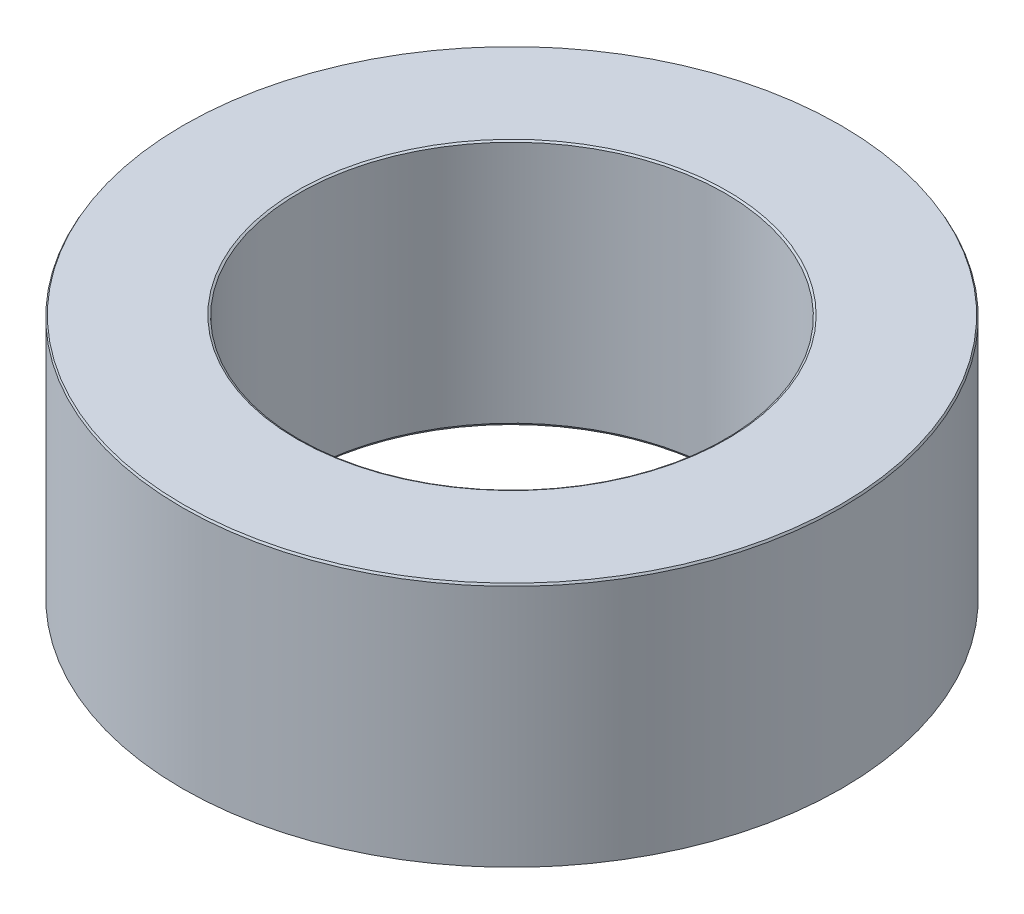
ISO-10303-21;
HEADER;
FILE_DESCRIPTION(('STEP AP214'),'2;1');
FILE_NAME('part.step','',(''),(''),'','','');
FILE_SCHEMA(('AUTOMOTIVE_DESIGN { 1 0 10303 214 1 1 1 1 }'));
ENDSEC;
DATA;
#1=APPLICATION_CONTEXT('core data for automotive mechanical design processes');
#2=APPLICATION_PROTOCOL_DEFINITION('international standard','automotive_design',2000,#1);
#3=PRODUCT_CONTEXT('',#1,'mechanical');
#4=PRODUCT('Part','Part','',(#3));
#5=PRODUCT_RELATED_PRODUCT_CATEGORY('part','',(#4));
#6=PRODUCT_DEFINITION_FORMATION('','',#4);
#7=PRODUCT_DEFINITION_CONTEXT('part definition',#1,'design');
#8=PRODUCT_DEFINITION('design','',#6,#7);
#9=PRODUCT_DEFINITION_SHAPE('','',#8);
#10=(LENGTH_UNIT() NAMED_UNIT(*) SI_UNIT(.MILLI.,.METRE.));
#11=(NAMED_UNIT(*) PLANE_ANGLE_UNIT() SI_UNIT($,.RADIAN.));
#12=(NAMED_UNIT(*) SI_UNIT($,.STERADIAN.) SOLID_ANGLE_UNIT());
#13=UNCERTAINTY_MEASURE_WITH_UNIT(LENGTH_MEASURE(1.E-05),#10,'distance_accuracy_value','');
#14=(GEOMETRIC_REPRESENTATION_CONTEXT(3) GLOBAL_UNCERTAINTY_ASSIGNED_CONTEXT((#13)) GLOBAL_UNIT_ASSIGNED_CONTEXT((#10,
#11,#12)) REPRESENTATION_CONTEXT('',''));
#15=CARTESIAN_POINT('',(0.,0.,0.));
#16=DIRECTION('',(0.,0.,1.));
#17=DIRECTION('',(1.,0.,0.));
#18=AXIS2_PLACEMENT_3D('',#15,#16,#17);
#19=CARTESIAN_POINT('',(0.,42.9853840431559,0.));
#20=DIRECTION('',(0.,-1.,0.));
#21=DIRECTION('',(0.,0.,-1.));
#22=AXIS2_PLACEMENT_3D('',#19,#20,#21);
#23=CYLINDRICAL_SURFACE('',#22,57.5);
#24=CARTESIAN_POINT('',(0.,0.20031282239473,0.));
#25=DIRECTION('',(0.,1.,0.));
#26=DIRECTION('',(0.,0.,1.));
#27=AXIS2_PLACEMENT_3D('',#24,#25,#26);
#28=CIRCLE('',#27,57.5);
#29=CARTESIAN_POINT('',(0.,0.20031282239473,57.5));
#30=VERTEX_POINT('',#29);
#31=EDGE_CURVE('E10',#30,#30,#28,.T.);
#32=ORIENTED_EDGE('',*,*,#31,.T.);
#33=EDGE_LOOP('',(#32));
#34=FACE_BOUND('',#33,.T.);
#35=CARTESIAN_POINT('',(0.,42.6384320573606,0.));
#36=DIRECTION('',(0.,1.,0.));
#37=DIRECTION('',(0.,0.,1.));
#38=AXIS2_PLACEMENT_3D('',#35,#36,#37);
#39=CIRCLE('',#38,57.5);
#40=CARTESIAN_POINT('',(0.,42.6384320573606,57.5));
#41=VERTEX_POINT('',#40);
#42=EDGE_CURVE('E50',#41,#41,#39,.F.);
#43=ORIENTED_EDGE('',*,*,#42,.T.);
#44=EDGE_LOOP('',(#43));
#45=FACE_BOUND('',#44,.T.);
#46=ADVANCED_FACE('F39',(#34,#45),#23,.T.);
#47=CARTESIAN_POINT('',(0.,42.9853840431559,0.));
#48=DIRECTION('',(0.,1.,0.));
#49=DIRECTION('',(0.,0.,1.));
#50=AXIS2_PLACEMENT_3D('',#47,#48,#49);
#51=PLANE('',#50);
#52=CARTESIAN_POINT('',(0.,42.9853840431559,0.));
#53=DIRECTION('',(0.,1.,0.));
#54=DIRECTION('',(0.,0.,1.));
#55=AXIS2_PLACEMENT_3D('',#52,#53,#54);
#56=CIRCLE('',#55,37.5136178351555);
#57=CARTESIAN_POINT('',(0.,42.9853840431559,37.5136178351555));
#58=VERTEX_POINT('',#57);
#59=EDGE_CURVE('E58',#58,#58,#56,.F.);
#60=ORIENTED_EDGE('',*,*,#59,.T.);
#61=EDGE_LOOP('',(#60));
#62=FACE_BOUND('',#61,.T.);
#63=CARTESIAN_POINT('',(0.,42.9853840431559,0.));
#64=DIRECTION('',(0.,1.,0.));
#65=DIRECTION('',(0.,0.,1.));
#66=AXIS2_PLACEMENT_3D('',#63,#64,#65);
#67=CIRCLE('',#66,57.2996871776052);
#68=CARTESIAN_POINT('',(0.,42.9853840431559,57.2996871776052));
#69=VERTEX_POINT('',#68);
#70=EDGE_CURVE('E61',#69,#69,#67,.T.);
#71=ORIENTED_EDGE('',*,*,#70,.T.);
#72=EDGE_LOOP('',(#71));
#73=FACE_BOUND('',#72,.T.);
#74=ADVANCED_FACE('F88',(#62,#73),#51,.T.);
#75=CARTESIAN_POINT('',(0.,0.,0.));
#76=DIRECTION('',(0.,1.,0.));
#77=DIRECTION('',(0.,0.,1.));
#78=AXIS2_PLACEMENT_3D('',#75,#76,#77);
#79=PLANE('',#78);
#80=CARTESIAN_POINT('',(0.,0.,0.));
#81=DIRECTION('',(0.,1.,0.));
#82=DIRECTION('',(0.,0.,1.));
#83=AXIS2_PLACEMENT_3D('',#80,#81,#82);
#84=CIRCLE('',#83,37.3669786717551);
#85=CARTESIAN_POINT('',(0.,0.,37.3669786717551));
#86=VERTEX_POINT('',#85);
#87=EDGE_CURVE('E51',#86,#86,#84,.T.);
#88=ORIENTED_EDGE('',*,*,#87,.T.);
#89=EDGE_LOOP('',(#88));
#90=FACE_BOUND('',#89,.T.);
#91=CARTESIAN_POINT('',(0.,0.,0.));
#92=DIRECTION('',(0.,1.,0.));
#93=DIRECTION('',(0.,0.,1.));
#94=AXIS2_PLACEMENT_3D('',#91,#92,#93);
#95=CIRCLE('',#94,57.1530480142048);
#96=CARTESIAN_POINT('',(0.,0.,57.1530480142048));
#97=VERTEX_POINT('',#96);
#98=EDGE_CURVE('E54',#97,#97,#95,.F.);
#99=ORIENTED_EDGE('',*,*,#98,.T.);
#100=EDGE_LOOP('',(#99));
#101=FACE_BOUND('',#100,.T.);
#102=ADVANCED_FACE('F83',(#90,#101),#79,.F.);
#103=CARTESIAN_POINT('',(0.,42.9853840431559,0.));
#104=DIRECTION('',(0.,-1.,0.));
#105=DIRECTION('',(0.,0.,-1.));
#106=AXIS2_PLACEMENT_3D('',#103,#104,#105);
#107=CYLINDRICAL_SURFACE('',#106,37.1666658493603);
#108=CARTESIAN_POINT('',(0.,42.7850712207612,0.));
#109=DIRECTION('',(0.,1.,0.));
#110=DIRECTION('',(0.,0.,1.));
#111=AXIS2_PLACEMENT_3D('',#108,#109,#110);
#112=CIRCLE('',#111,37.1666658493603);
#113=CARTESIAN_POINT('',(0.,42.7850712207612,37.1666658493603));
#114=VERTEX_POINT('',#113);
#115=EDGE_CURVE('E67',#114,#114,#112,.T.);
#116=ORIENTED_EDGE('',*,*,#115,.T.);
#117=EDGE_LOOP('',(#116));
#118=FACE_BOUND('',#117,.T.);
#119=CARTESIAN_POINT('',(0.,0.346951985795221,0.));
#120=DIRECTION('',(0.,1.,0.));
#121=DIRECTION('',(0.,0.,1.));
#122=AXIS2_PLACEMENT_3D('',#119,#120,#121);
#123=CIRCLE('',#122,37.1666658493603);
#124=CARTESIAN_POINT('',(0.,0.346951985795221,37.1666658493603));
#125=VERTEX_POINT('',#124);
#126=EDGE_CURVE('E69',#125,#125,#123,.F.);
#127=ORIENTED_EDGE('',*,*,#126,.T.);
#128=EDGE_LOOP('',(#127));
#129=FACE_BOUND('',#128,.T.);
#130=ADVANCED_FACE('F71',(#118,#129),#107,.F.);
#131=CARTESIAN_POINT('',(0.,42.7850712207612,0.));
#132=DIRECTION('',(0.,1.,0.));
#133=DIRECTION('',(0.,0.,1.));
#134=AXIS2_PLACEMENT_3D('',#131,#132,#133);
#135=CONICAL_SURFACE('',#134,37.1666658493603,1.0471975511966);
#136=ORIENTED_EDGE('',*,*,#59,.F.);
#137=EDGE_LOOP('',(#136));
#138=FACE_BOUND('',#137,.T.);
#139=ORIENTED_EDGE('',*,*,#115,.F.);
#140=EDGE_LOOP('',(#139));
#141=FACE_BOUND('',#140,.T.);
#142=ADVANCED_FACE('F77',(#138,#141),#135,.F.);
#143=CARTESIAN_POINT('',(0.,0.,0.));
#144=DIRECTION('',(0.,-1.,0.));
#145=DIRECTION('',(0.,0.,-1.));
#146=AXIS2_PLACEMENT_3D('',#143,#144,#145);
#147=CONICAL_SURFACE('',#146,37.3669786717551,0.523598775598293);
#148=ORIENTED_EDGE('',*,*,#126,.F.);
#149=EDGE_LOOP('',(#148));
#150=FACE_BOUND('',#149,.T.);
#151=ORIENTED_EDGE('',*,*,#87,.F.);
#152=EDGE_LOOP('',(#151));
#153=FACE_BOUND('',#152,.T.);
#154=ADVANCED_FACE('F73',(#150,#153),#147,.F.);
#155=CARTESIAN_POINT('',(0.,0.20031282239473,0.));
#156=DIRECTION('',(0.,1.,0.));
#157=DIRECTION('',(0.,0.,1.));
#158=AXIS2_PLACEMENT_3D('',#155,#156,#157);
#159=CONICAL_SURFACE('',#158,57.5,1.0471975511966);
#160=ORIENTED_EDGE('',*,*,#98,.F.);
#161=EDGE_LOOP('',(#160));
#162=FACE_BOUND('',#161,.T.);
#163=ORIENTED_EDGE('',*,*,#31,.F.);
#164=EDGE_LOOP('',(#163));
#165=FACE_BOUND('',#164,.T.);
#166=ADVANCED_FACE('F76',(#162,#165),#159,.T.);
#167=CARTESIAN_POINT('',(0.,42.9853840431559,0.));
#168=DIRECTION('',(0.,-1.,0.));
#169=DIRECTION('',(0.,0.,-1.));
#170=AXIS2_PLACEMENT_3D('',#167,#168,#169);
#171=CONICAL_SURFACE('',#170,57.2996871776052,0.523598775598324);
#172=ORIENTED_EDGE('',*,*,#42,.F.);
#173=EDGE_LOOP('',(#172));
#174=FACE_BOUND('',#173,.T.);
#175=ORIENTED_EDGE('',*,*,#70,.F.);
#176=EDGE_LOOP('',(#175));
#177=FACE_BOUND('',#176,.T.);
#178=ADVANCED_FACE('F45',(#174,#177),#171,.T.);
#179=CLOSED_SHELL('',(#46,#74,#102,#130,#142,#154,#166,#178));
#180=MANIFOLD_SOLID_BREP('B2',#179);
#181=ADVANCED_BREP_SHAPE_REPRESENTATION('',(#18,#180),#14);
#182=SHAPE_DEFINITION_REPRESENTATION(#9,#181);
ENDSEC;
END-ISO-10303-21;
